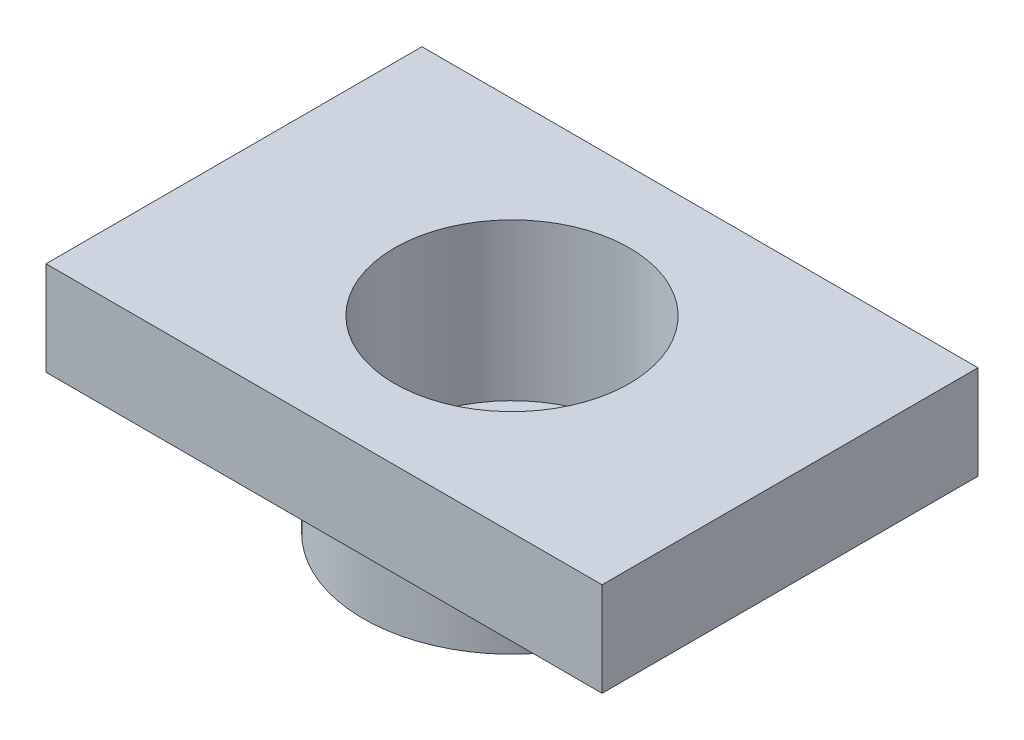
ISO-10303-21;
HEADER;
FILE_DESCRIPTION(('STEP AP214'),'2;1');
FILE_NAME('part.step','',(''),(''),'','','');
FILE_SCHEMA(('AUTOMOTIVE_DESIGN { 1 0 10303 214 1 1 1 1 }'));
ENDSEC;
DATA;
#1=APPLICATION_CONTEXT('core data for automotive mechanical design processes');
#2=APPLICATION_PROTOCOL_DEFINITION('international standard','automotive_design',2000,#1);
#3=PRODUCT_CONTEXT('',#1,'mechanical');
#4=PRODUCT('Part','Part','',(#3));
#5=PRODUCT_RELATED_PRODUCT_CATEGORY('part','',(#4));
#6=PRODUCT_DEFINITION_FORMATION('','',#4);
#7=PRODUCT_DEFINITION_CONTEXT('part definition',#1,'design');
#8=PRODUCT_DEFINITION('design','',#6,#7);
#9=PRODUCT_DEFINITION_SHAPE('','',#8);
#10=(LENGTH_UNIT() NAMED_UNIT(*) SI_UNIT(.MILLI.,.METRE.));
#11=(NAMED_UNIT(*) PLANE_ANGLE_UNIT() SI_UNIT($,.RADIAN.));
#12=(NAMED_UNIT(*) SI_UNIT($,.STERADIAN.) SOLID_ANGLE_UNIT());
#13=UNCERTAINTY_MEASURE_WITH_UNIT(LENGTH_MEASURE(1.E-05),#10,'distance_accuracy_value','');
#14=(GEOMETRIC_REPRESENTATION_CONTEXT(3) GLOBAL_UNCERTAINTY_ASSIGNED_CONTEXT((#13)) GLOBAL_UNIT_ASSIGNED_CONTEXT((#10,
#11,#12)) REPRESENTATION_CONTEXT('',''));
#15=CARTESIAN_POINT('',(0.,0.,0.));
#16=DIRECTION('',(0.,0.,1.));
#17=DIRECTION('',(1.,0.,0.));
#18=AXIS2_PLACEMENT_3D('',#15,#16,#17);
#19=CARTESIAN_POINT('',(59.,0.,0.));
#20=DIRECTION('',(0.,-1.,0.));
#21=DIRECTION('',(1.,0.,0.));
#22=AXIS2_PLACEMENT_3D('',#19,#20,#21);
#23=PLANE('',#22);
#24=CARTESIAN_POINT('',(0.,0.,0.));
#25=DIRECTION('',(0.,1.,0.));
#26=DIRECTION('',(-1.,0.,0.));
#27=AXIS2_PLACEMENT_3D('',#24,#25,#26);
#28=CIRCLE('',#27,15.);
#29=CARTESIAN_POINT('',(-15.,0.,0.));
#30=VERTEX_POINT('',#29);
#31=EDGE_CURVE('E121',#30,#30,#28,.T.);
#32=ORIENTED_EDGE('',*,*,#31,.F.);
#33=EDGE_LOOP('',(#32));
#34=FACE_BOUND('',#33,.T.);
#35=DIRECTION('',(1.,0.,0.));
#36=VECTOR('',#35,1.);
#37=CARTESIAN_POINT('',(35.5,0.,-24.));
#38=LINE('',#37,#36);
#39=CARTESIAN_POINT('',(-35.5000000000001,0.,-24.));
#40=VERTEX_POINT('',#39);
#41=CARTESIAN_POINT('',(35.5,0.,-24.));
#42=VERTEX_POINT('',#41);
#43=EDGE_CURVE('E47',#40,#42,#38,.T.);
#44=ORIENTED_EDGE('',*,*,#43,.F.);
#45=DIRECTION('',(0.,0.,-1.));
#46=VECTOR('',#45,1.);
#47=CARTESIAN_POINT('',(-35.5000000000001,0.,-24.));
#48=LINE('',#47,#46);
#49=CARTESIAN_POINT('',(-35.5000000000001,0.,24.));
#50=VERTEX_POINT('',#49);
#51=EDGE_CURVE('E77',#50,#40,#48,.T.);
#52=ORIENTED_EDGE('',*,*,#51,.F.);
#53=DIRECTION('',(-1.,0.,0.));
#54=VECTOR('',#53,1.);
#55=CARTESIAN_POINT('',(35.5,0.,24.));
#56=LINE('',#55,#54);
#57=CARTESIAN_POINT('',(35.5,0.,24.));
#58=VERTEX_POINT('',#57);
#59=EDGE_CURVE('E84',#58,#50,#56,.T.);
#60=ORIENTED_EDGE('',*,*,#59,.F.);
#61=DIRECTION('',(0.,0.,1.));
#62=VECTOR('',#61,1.);
#63=CARTESIAN_POINT('',(35.5,0.,-24.));
#64=LINE('',#63,#62);
#65=EDGE_CURVE('E89',#42,#58,#64,.T.);
#66=ORIENTED_EDGE('',*,*,#65,.F.);
#67=EDGE_LOOP('',(#44,#52,#60,#66));
#68=FACE_BOUND('',#67,.T.);
#69=ADVANCED_FACE('F31',(#34,#68),#23,.F.);
#70=CARTESIAN_POINT('',(19.,-12.,0.));
#71=DIRECTION('',(0.,1.,0.));
#72=DIRECTION('',(-1.,0.,0.));
#73=AXIS2_PLACEMENT_3D('',#70,#71,#72);
#74=PLANE('',#73);
#75=CARTESIAN_POINT('',(0.,-12.,0.));
#76=DIRECTION('',(0.,1.,0.));
#77=DIRECTION('',(-1.,0.,0.));
#78=AXIS2_PLACEMENT_3D('',#75,#76,#77);
#79=CIRCLE('',#78,19.);
#80=CARTESIAN_POINT('',(-19.,-12.,0.));
#81=VERTEX_POINT('',#80);
#82=EDGE_CURVE('E12',#81,#81,#79,.T.);
#83=ORIENTED_EDGE('',*,*,#82,.T.);
#84=EDGE_LOOP('',(#83));
#85=FACE_BOUND('',#84,.T.);
#86=DIRECTION('',(1.,0.,0.));
#87=VECTOR('',#86,1.);
#88=CARTESIAN_POINT('',(35.5,-12.,-24.));
#89=LINE('',#88,#87);
#90=CARTESIAN_POINT('',(-35.5000000000001,-12.,-24.));
#91=VERTEX_POINT('',#90);
#92=CARTESIAN_POINT('',(35.5,-12.,-24.));
#93=VERTEX_POINT('',#92);
#94=EDGE_CURVE('E96',#91,#93,#89,.T.);
#95=ORIENTED_EDGE('',*,*,#94,.T.);
#96=DIRECTION('',(0.,0.,1.));
#97=VECTOR('',#96,1.);
#98=CARTESIAN_POINT('',(35.5,-12.,-24.));
#99=LINE('',#98,#97);
#100=CARTESIAN_POINT('',(35.5,-12.,24.));
#101=VERTEX_POINT('',#100);
#102=EDGE_CURVE('E99',#93,#101,#99,.T.);
#103=ORIENTED_EDGE('',*,*,#102,.T.);
#104=DIRECTION('',(-1.,0.,0.));
#105=VECTOR('',#104,1.);
#106=CARTESIAN_POINT('',(35.5,-12.,24.));
#107=LINE('',#106,#105);
#108=CARTESIAN_POINT('',(-35.5000000000001,-12.,24.));
#109=VERTEX_POINT('',#108);
#110=EDGE_CURVE('E55',#101,#109,#107,.T.);
#111=ORIENTED_EDGE('',*,*,#110,.T.);
#112=DIRECTION('',(0.,0.,-1.));
#113=VECTOR('',#112,1.);
#114=CARTESIAN_POINT('',(-35.5000000000001,-12.,-24.));
#115=LINE('',#114,#113);
#116=EDGE_CURVE('E79',#109,#91,#115,.T.);
#117=ORIENTED_EDGE('',*,*,#116,.T.);
#118=EDGE_LOOP('',(#95,#103,#111,#117));
#119=FACE_BOUND('',#118,.T.);
#120=ADVANCED_FACE('F161',(#85,#119),#74,.F.);
#121=CARTESIAN_POINT('',(0.,0.,0.));
#122=DIRECTION('',(0.,1.,0.));
#123=DIRECTION('',(-1.,0.,0.));
#124=AXIS2_PLACEMENT_3D('',#121,#122,#123);
#125=CYLINDRICAL_SURFACE('',#124,19.);
#126=ORIENTED_EDGE('',*,*,#82,.F.);
#127=EDGE_LOOP('',(#126));
#128=FACE_BOUND('',#127,.T.);
#129=CARTESIAN_POINT('',(0.,-24.,0.));
#130=DIRECTION('',(0.,1.,0.));
#131=DIRECTION('',(-1.,0.,0.));
#132=AXIS2_PLACEMENT_3D('',#129,#130,#131);
#133=CIRCLE('',#132,19.);
#134=CARTESIAN_POINT('',(-19.,-24.,0.));
#135=VERTEX_POINT('',#134);
#136=EDGE_CURVE('E39',#135,#135,#133,.T.);
#137=ORIENTED_EDGE('',*,*,#136,.T.);
#138=EDGE_LOOP('',(#137));
#139=FACE_BOUND('',#138,.T.);
#140=ADVANCED_FACE('F166',(#128,#139),#125,.T.);
#141=CARTESIAN_POINT('',(9.,-24.,0.));
#142=DIRECTION('',(0.,1.,0.));
#143=DIRECTION('',(-1.,0.,0.));
#144=AXIS2_PLACEMENT_3D('',#141,#142,#143);
#145=PLANE('',#144);
#146=CARTESIAN_POINT('',(-12.9999999999998,-24.,-1.81557108488227E-13));
#147=DIRECTION('',(0.,-1.,0.));
#148=DIRECTION('',(1.,0.,0.));
#149=AXIS2_PLACEMENT_3D('',#146,#147,#148);
#150=CIRCLE('',#149,1.50000000000036);
#151=CARTESIAN_POINT('',(-11.4999999999995,-24.,-1.81557108488227E-13));
#152=VERTEX_POINT('',#151);
#153=EDGE_CURVE('E104',#152,#152,#150,.T.);
#154=ORIENTED_EDGE('',*,*,#153,.F.);
#155=EDGE_LOOP('',(#154));
#156=FACE_BOUND('',#155,.T.);
#157=CARTESIAN_POINT('',(3.6923745097219E-13,-24.,-13.));
#158=DIRECTION('',(0.,-1.,0.));
#159=DIRECTION('',(1.,0.,0.));
#160=AXIS2_PLACEMENT_3D('',#157,#158,#159);
#161=CIRCLE('',#160,1.50000000000044);
#162=CARTESIAN_POINT('',(1.50000000000081,-24.,-13.));
#163=VERTEX_POINT('',#162);
#164=EDGE_CURVE('E109',#163,#163,#161,.T.);
#165=ORIENTED_EDGE('',*,*,#164,.F.);
#166=EDGE_LOOP('',(#165));
#167=FACE_BOUND('',#166,.T.);
#168=CARTESIAN_POINT('',(13.,-24.,0.));
#169=DIRECTION('',(0.,-1.,0.));
#170=DIRECTION('',(1.,0.,0.));
#171=AXIS2_PLACEMENT_3D('',#168,#169,#170);
#172=CIRCLE('',#171,1.5);
#173=CARTESIAN_POINT('',(14.5,-24.,0.));
#174=VERTEX_POINT('',#173);
#175=EDGE_CURVE('E113',#174,#174,#172,.T.);
#176=ORIENTED_EDGE('',*,*,#175,.F.);
#177=EDGE_LOOP('',(#176));
#178=FACE_BOUND('',#177,.T.);
#179=CARTESIAN_POINT('',(0.,-24.,13.));
#180=DIRECTION('',(0.,-1.,0.));
#181=DIRECTION('',(1.,0.,0.));
#182=AXIS2_PLACEMENT_3D('',#179,#180,#181);
#183=CIRCLE('',#182,1.5);
#184=CARTESIAN_POINT('',(1.5,-24.,13.));
#185=VERTEX_POINT('',#184);
#186=EDGE_CURVE('E117',#185,#185,#183,.T.);
#187=ORIENTED_EDGE('',*,*,#186,.F.);
#188=EDGE_LOOP('',(#187));
#189=FACE_BOUND('',#188,.T.);
#190=ORIENTED_EDGE('',*,*,#136,.F.);
#191=EDGE_LOOP('',(#190));
#192=FACE_BOUND('',#191,.T.);
#193=CARTESIAN_POINT('',(0.,-24.,0.));
#194=DIRECTION('',(0.,1.,0.));
#195=DIRECTION('',(-1.,0.,0.));
#196=AXIS2_PLACEMENT_3D('',#193,#194,#195);
#197=CIRCLE('',#196,9.);
#198=CARTESIAN_POINT('',(-8.99999999999999,-24.,0.));
#199=VERTEX_POINT('',#198);
#200=EDGE_CURVE('E130',#199,#199,#197,.T.);
#201=ORIENTED_EDGE('',*,*,#200,.T.);
#202=EDGE_LOOP('',(#201));
#203=FACE_BOUND('',#202,.T.);
#204=ADVANCED_FACE('F187',(#156,#167,#178,#189,#192,#203),#145,.F.);
#205=CARTESIAN_POINT('',(0.,0.,0.));
#206=DIRECTION('',(0.,1.,0.));
#207=DIRECTION('',(-1.,0.,0.));
#208=AXIS2_PLACEMENT_3D('',#205,#206,#207);
#209=CYLINDRICAL_SURFACE('',#208,9.);
#210=ORIENTED_EDGE('',*,*,#200,.F.);
#211=EDGE_LOOP('',(#210));
#212=FACE_BOUND('',#211,.T.);
#213=CARTESIAN_POINT('',(0.,-20.,0.));
#214=DIRECTION('',(0.,1.,0.));
#215=DIRECTION('',(-1.,0.,0.));
#216=AXIS2_PLACEMENT_3D('',#213,#214,#215);
#217=CIRCLE('',#216,9.);
#218=CARTESIAN_POINT('',(-9.,-20.,0.));
#219=VERTEX_POINT('',#218);
#220=EDGE_CURVE('E127',#219,#219,#217,.T.);
#221=ORIENTED_EDGE('',*,*,#220,.T.);
#222=EDGE_LOOP('',(#221));
#223=FACE_BOUND('',#222,.T.);
#224=ADVANCED_FACE('F180',(#212,#223),#209,.F.);
#225=CARTESIAN_POINT('',(15.,-20.,0.));
#226=DIRECTION('',(0.,-1.,0.));
#227=DIRECTION('',(1.,0.,0.));
#228=AXIS2_PLACEMENT_3D('',#225,#226,#227);
#229=PLANE('',#228);
#230=CARTESIAN_POINT('',(-12.9999999999998,-20.,-1.81557108488227E-13));
#231=DIRECTION('',(0.,-1.,0.));
#232=DIRECTION('',(1.,0.,0.));
#233=AXIS2_PLACEMENT_3D('',#230,#231,#232);
#234=CIRCLE('',#233,1.50000000000036);
#235=CARTESIAN_POINT('',(-11.4999999999995,-20.,-1.81557108488227E-13));
#236=VERTEX_POINT('',#235);
#237=EDGE_CURVE('E34',#236,#236,#234,.T.);
#238=ORIENTED_EDGE('',*,*,#237,.T.);
#239=EDGE_LOOP('',(#238));
#240=FACE_BOUND('',#239,.T.);
#241=CARTESIAN_POINT('',(3.68747592252531E-13,-20.,-13.));
#242=DIRECTION('',(0.,-1.,0.));
#243=DIRECTION('',(1.,0.,0.));
#244=AXIS2_PLACEMENT_3D('',#241,#242,#243);
#245=CIRCLE('',#244,1.50000000000044);
#246=CARTESIAN_POINT('',(1.50000000000081,-20.,-13.));
#247=VERTEX_POINT('',#246);
#248=EDGE_CURVE('E112',#247,#247,#245,.T.);
#249=ORIENTED_EDGE('',*,*,#248,.T.);
#250=EDGE_LOOP('',(#249));
#251=FACE_BOUND('',#250,.T.);
#252=CARTESIAN_POINT('',(13.,-20.,0.));
#253=DIRECTION('',(0.,-1.,0.));
#254=DIRECTION('',(1.,0.,0.));
#255=AXIS2_PLACEMENT_3D('',#252,#253,#254);
#256=CIRCLE('',#255,1.5);
#257=CARTESIAN_POINT('',(14.5,-20.,0.));
#258=VERTEX_POINT('',#257);
#259=EDGE_CURVE('E116',#258,#258,#256,.T.);
#260=ORIENTED_EDGE('',*,*,#259,.T.);
#261=EDGE_LOOP('',(#260));
#262=FACE_BOUND('',#261,.T.);
#263=CARTESIAN_POINT('',(0.,-20.,13.));
#264=DIRECTION('',(0.,-1.,0.));
#265=DIRECTION('',(1.,0.,0.));
#266=AXIS2_PLACEMENT_3D('',#263,#264,#265);
#267=CIRCLE('',#266,1.5);
#268=CARTESIAN_POINT('',(1.5,-20.,13.));
#269=VERTEX_POINT('',#268);
#270=EDGE_CURVE('E120',#269,#269,#267,.T.);
#271=ORIENTED_EDGE('',*,*,#270,.T.);
#272=EDGE_LOOP('',(#271));
#273=FACE_BOUND('',#272,.T.);
#274=ORIENTED_EDGE('',*,*,#220,.F.);
#275=EDGE_LOOP('',(#274));
#276=FACE_BOUND('',#275,.T.);
#277=CARTESIAN_POINT('',(0.,-20.,0.));
#278=DIRECTION('',(0.,1.,0.));
#279=DIRECTION('',(-1.,0.,0.));
#280=AXIS2_PLACEMENT_3D('',#277,#278,#279);
#281=CIRCLE('',#280,15.);
#282=CARTESIAN_POINT('',(-15.,-20.,0.));
#283=VERTEX_POINT('',#282);
#284=EDGE_CURVE('E124',#283,#283,#281,.T.);
#285=ORIENTED_EDGE('',*,*,#284,.T.);
#286=EDGE_LOOP('',(#285));
#287=FACE_BOUND('',#286,.T.);
#288=ADVANCED_FACE('F141',(#240,#251,#262,#273,#276,#287),#229,.F.);
#289=CARTESIAN_POINT('',(0.,0.,0.));
#290=DIRECTION('',(0.,1.,0.));
#291=DIRECTION('',(-1.,0.,0.));
#292=AXIS2_PLACEMENT_3D('',#289,#290,#291);
#293=CYLINDRICAL_SURFACE('',#292,15.);
#294=ORIENTED_EDGE('',*,*,#284,.F.);
#295=EDGE_LOOP('',(#294));
#296=FACE_BOUND('',#295,.T.);
#297=ORIENTED_EDGE('',*,*,#31,.T.);
#298=EDGE_LOOP('',(#297));
#299=FACE_BOUND('',#298,.T.);
#300=ADVANCED_FACE('F170',(#296,#299),#293,.F.);
#301=CARTESIAN_POINT('',(0.,0.,13.));
#302=DIRECTION('',(0.,-1.,0.));
#303=DIRECTION('',(1.,0.,0.));
#304=AXIS2_PLACEMENT_3D('',#301,#302,#303);
#305=CYLINDRICAL_SURFACE('',#304,1.5);
#306=ORIENTED_EDGE('',*,*,#186,.T.);
#307=EDGE_LOOP('',(#306));
#308=FACE_BOUND('',#307,.T.);
#309=ORIENTED_EDGE('',*,*,#270,.F.);
#310=EDGE_LOOP('',(#309));
#311=FACE_BOUND('',#310,.T.);
#312=ADVANCED_FACE('F157',(#308,#311),#305,.F.);
#313=CARTESIAN_POINT('',(13.,0.,0.));
#314=DIRECTION('',(0.,-1.,0.));
#315=DIRECTION('',(1.,0.,0.));
#316=AXIS2_PLACEMENT_3D('',#313,#314,#315);
#317=CYLINDRICAL_SURFACE('',#316,1.5);
#318=ORIENTED_EDGE('',*,*,#175,.T.);
#319=EDGE_LOOP('',(#318));
#320=FACE_BOUND('',#319,.T.);
#321=ORIENTED_EDGE('',*,*,#259,.F.);
#322=EDGE_LOOP('',(#321));
#323=FACE_BOUND('',#322,.T.);
#324=ADVANCED_FACE('F147',(#320,#323),#317,.F.);
#325=CARTESIAN_POINT('',(3.66298298654236E-13,0.,-13.));
#326=DIRECTION('',(0.,-1.,0.));
#327=DIRECTION('',(1.,0.,0.));
#328=AXIS2_PLACEMENT_3D('',#325,#326,#327);
#329=CYLINDRICAL_SURFACE('',#328,1.50000000000044);
#330=ORIENTED_EDGE('',*,*,#164,.T.);
#331=EDGE_LOOP('',(#330));
#332=FACE_BOUND('',#331,.T.);
#333=ORIENTED_EDGE('',*,*,#248,.F.);
#334=EDGE_LOOP('',(#333));
#335=FACE_BOUND('',#334,.T.);
#336=ADVANCED_FACE('F144',(#332,#335),#329,.F.);
#337=CARTESIAN_POINT('',(-12.9999999999998,0.,-1.81557108488227E-13));
#338=DIRECTION('',(0.,-1.,0.));
#339=DIRECTION('',(1.,0.,0.));
#340=AXIS2_PLACEMENT_3D('',#337,#338,#339);
#341=CYLINDRICAL_SURFACE('',#340,1.50000000000036);
#342=ORIENTED_EDGE('',*,*,#153,.T.);
#343=EDGE_LOOP('',(#342));
#344=FACE_BOUND('',#343,.T.);
#345=ORIENTED_EDGE('',*,*,#237,.F.);
#346=EDGE_LOOP('',(#345));
#347=FACE_BOUND('',#346,.T.);
#348=ADVANCED_FACE('F146',(#344,#347),#341,.F.);
#349=CARTESIAN_POINT('',(35.5,0.,-24.));
#350=DIRECTION('',(0.,0.,-1.));
#351=DIRECTION('',(-1.,0.,0.));
#352=AXIS2_PLACEMENT_3D('',#349,#350,#351);
#353=PLANE('',#352);
#354=ORIENTED_EDGE('',*,*,#94,.F.);
#355=DIRECTION('',(0.,-1.,0.));
#356=VECTOR('',#355,1.);
#357=CARTESIAN_POINT('',(-35.5000000000001,0.,-24.));
#358=LINE('',#357,#356);
#359=EDGE_CURVE('E80',#40,#91,#358,.T.);
#360=ORIENTED_EDGE('',*,*,#359,.F.);
#361=ORIENTED_EDGE('',*,*,#43,.T.);
#362=DIRECTION('',(0.,-1.,0.));
#363=VECTOR('',#362,1.);
#364=CARTESIAN_POINT('',(35.5,0.,-24.));
#365=LINE('',#364,#363);
#366=EDGE_CURVE('E91',#42,#93,#365,.T.);
#367=ORIENTED_EDGE('',*,*,#366,.T.);
#368=EDGE_LOOP('',(#354,#360,#361,#367));
#369=FACE_BOUND('',#368,.T.);
#370=ADVANCED_FACE('F154',(#369),#353,.T.);
#371=CARTESIAN_POINT('',(-35.5000000000001,0.,-24.));
#372=DIRECTION('',(-1.,0.,0.));
#373=DIRECTION('',(0.,0.,1.));
#374=AXIS2_PLACEMENT_3D('',#371,#372,#373);
#375=PLANE('',#374);
#376=ORIENTED_EDGE('',*,*,#116,.F.);
#377=DIRECTION('',(0.,-1.,0.));
#378=VECTOR('',#377,1.);
#379=CARTESIAN_POINT('',(-35.5000000000001,0.,24.));
#380=LINE('',#379,#378);
#381=EDGE_CURVE('E73',#50,#109,#380,.T.);
#382=ORIENTED_EDGE('',*,*,#381,.F.);
#383=ORIENTED_EDGE('',*,*,#51,.T.);
#384=ORIENTED_EDGE('',*,*,#359,.T.);
#385=EDGE_LOOP('',(#376,#382,#383,#384));
#386=FACE_BOUND('',#385,.T.);
#387=ADVANCED_FACE('F75',(#386),#375,.T.);
#388=CARTESIAN_POINT('',(35.5,0.,24.));
#389=DIRECTION('',(0.,0.,1.));
#390=DIRECTION('',(1.,0.,0.));
#391=AXIS2_PLACEMENT_3D('',#388,#389,#390);
#392=PLANE('',#391);
#393=ORIENTED_EDGE('',*,*,#110,.F.);
#394=DIRECTION('',(0.,-1.,0.));
#395=VECTOR('',#394,1.);
#396=CARTESIAN_POINT('',(35.5,0.,24.));
#397=LINE('',#396,#395);
#398=EDGE_CURVE('E81',#58,#101,#397,.T.);
#399=ORIENTED_EDGE('',*,*,#398,.F.);
#400=ORIENTED_EDGE('',*,*,#59,.T.);
#401=ORIENTED_EDGE('',*,*,#381,.T.);
#402=EDGE_LOOP('',(#393,#399,#400,#401));
#403=FACE_BOUND('',#402,.T.);
#404=ADVANCED_FACE('F85',(#403),#392,.T.);
#405=CARTESIAN_POINT('',(35.5,0.,-24.));
#406=DIRECTION('',(1.,0.,0.));
#407=DIRECTION('',(0.,0.,-1.));
#408=AXIS2_PLACEMENT_3D('',#405,#406,#407);
#409=PLANE('',#408);
#410=ORIENTED_EDGE('',*,*,#102,.F.);
#411=ORIENTED_EDGE('',*,*,#366,.F.);
#412=ORIENTED_EDGE('',*,*,#65,.T.);
#413=ORIENTED_EDGE('',*,*,#398,.T.);
#414=EDGE_LOOP('',(#410,#411,#412,#413));
#415=FACE_BOUND('',#414,.T.);
#416=ADVANCED_FACE('F210',(#415),#409,.T.);
#417=CLOSED_SHELL('',(#69,#120,#140,#204,#224,#288,#300,#312,#324,#336,#348,#370,#387,#404,#416));
#418=MANIFOLD_SOLID_BREP('B2',#417);
#419=ADVANCED_BREP_SHAPE_REPRESENTATION('',(#18,#418),#14);
#420=SHAPE_DEFINITION_REPRESENTATION(#9,#419);
ENDSEC;
END-ISO-10303-21;
